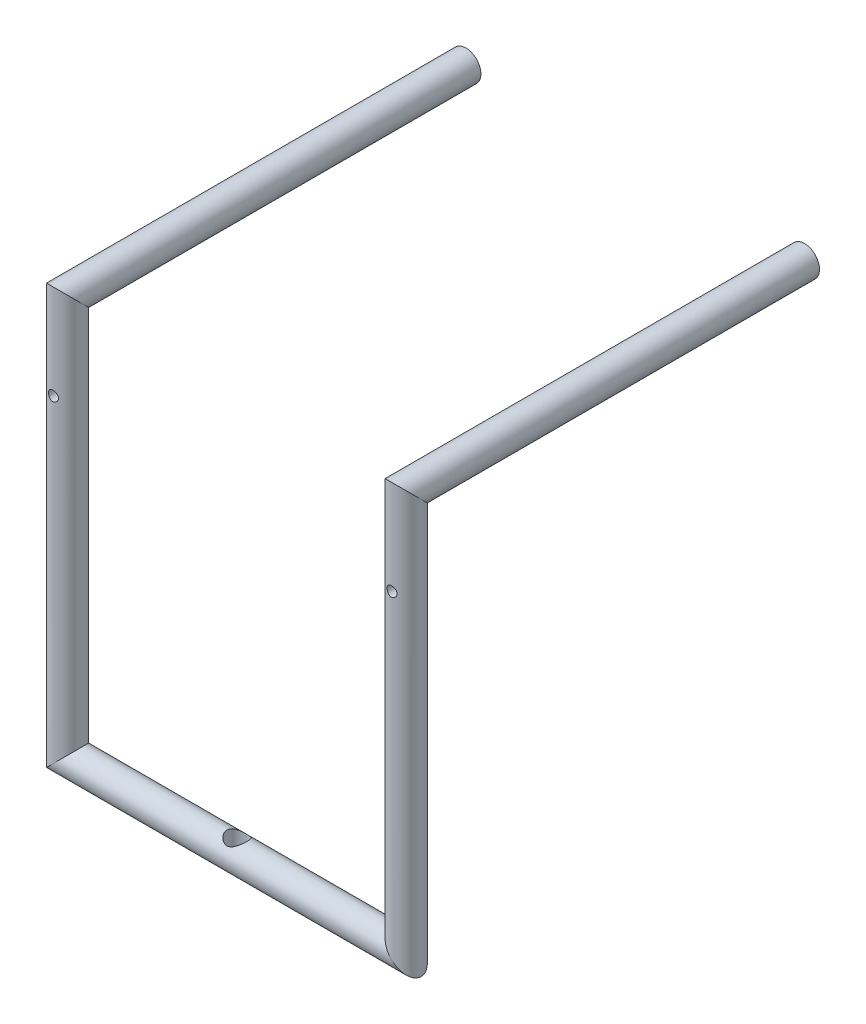
ISO-10303-21;
HEADER;
FILE_DESCRIPTION(('STEP AP214'),'2;1');
FILE_NAME('part.step','',(''),(''),'','','');
FILE_SCHEMA(('AUTOMOTIVE_DESIGN { 1 0 10303 214 1 1 1 1 }'));
ENDSEC;
DATA;
#1=APPLICATION_CONTEXT('core data for automotive mechanical design processes');
#2=APPLICATION_PROTOCOL_DEFINITION('international standard','automotive_design',2000,#1);
#3=PRODUCT_CONTEXT('',#1,'mechanical');
#4=PRODUCT('Part','Part','',(#3));
#5=PRODUCT_RELATED_PRODUCT_CATEGORY('part','',(#4));
#6=PRODUCT_DEFINITION_FORMATION('','',#4);
#7=PRODUCT_DEFINITION_CONTEXT('part definition',#1,'design');
#8=PRODUCT_DEFINITION('design','',#6,#7);
#9=PRODUCT_DEFINITION_SHAPE('','',#8);
#10=(LENGTH_UNIT() NAMED_UNIT(*) SI_UNIT(.MILLI.,.METRE.));
#11=(NAMED_UNIT(*) PLANE_ANGLE_UNIT() SI_UNIT($,.RADIAN.));
#12=(NAMED_UNIT(*) SI_UNIT($,.STERADIAN.) SOLID_ANGLE_UNIT());
#13=UNCERTAINTY_MEASURE_WITH_UNIT(LENGTH_MEASURE(1.E-05),#10,'distance_accuracy_value','');
#14=(GEOMETRIC_REPRESENTATION_CONTEXT(3) GLOBAL_UNCERTAINTY_ASSIGNED_CONTEXT((#13)) GLOBAL_UNIT_ASSIGNED_CONTEXT((#10,
#11,#12)) REPRESENTATION_CONTEXT('',''));
#15=CARTESIAN_POINT('',(0.,0.,0.));
#16=DIRECTION('',(0.,0.,1.));
#17=DIRECTION('',(1.,0.,0.));
#18=AXIS2_PLACEMENT_3D('',#15,#16,#17);
#19=CARTESIAN_POINT('',(8.5,20.,-20.));
#20=DIRECTION('',(0.,0.,1.));
#21=DIRECTION('',(1.,0.,0.));
#22=AXIS2_PLACEMENT_3D('',#19,#20,#21);
#23=PLANE('',#22);
#24=CARTESIAN_POINT('',(8.5,20.,-20.));
#25=DIRECTION('',(0.,0.,1.));
#26=DIRECTION('',(1.,0.,0.));
#27=AXIS2_PLACEMENT_3D('',#24,#25,#26);
#28=CIRCLE('',#27,0.75);
#29=CARTESIAN_POINT('',(9.25,20.,-20.));
#30=VERTEX_POINT('',#29);
#31=EDGE_CURVE('E69',#30,#30,#28,.T.);
#32=ORIENTED_EDGE('',*,*,#31,.F.);
#33=EDGE_LOOP('',(#32));
#34=FACE_BOUND('',#33,.T.);
#35=ADVANCED_FACE('F36',(#34),#23,.F.);
#36=CARTESIAN_POINT('',(-8.5,20.,-20.));
#37=DIRECTION('',(0.,0.,-1.));
#38=DIRECTION('',(-1.,0.,0.));
#39=AXIS2_PLACEMENT_3D('',#36,#37,#38);
#40=PLANE('',#39);
#41=CARTESIAN_POINT('',(-8.5,20.,-20.));
#42=DIRECTION('',(0.,0.,-1.));
#43=DIRECTION('',(-1.,0.,0.));
#44=AXIS2_PLACEMENT_3D('',#41,#42,#43);
#45=CIRCLE('',#44,0.75);
#46=CARTESIAN_POINT('',(-9.25,20.,-20.));
#47=VERTEX_POINT('',#46);
#48=EDGE_CURVE('E49',#47,#47,#45,.T.);
#49=ORIENTED_EDGE('',*,*,#48,.T.);
#50=EDGE_LOOP('',(#49));
#51=FACE_BOUND('',#50,.T.);
#52=ADVANCED_FACE('F153',(#51),#40,.T.);
#53=CARTESIAN_POINT('',(8.5,20.,1.75000000000001));
#54=DIRECTION('',(0.,0.,-1.));
#55=DIRECTION('',(-1.,0.,0.));
#56=AXIS2_PLACEMENT_3D('',#53,#54,#55);
#57=CYLINDRICAL_SURFACE('',#56,0.75);
#58=CARTESIAN_POINT('',(8.5,20.,0.));
#59=DIRECTION('',(0.,0.707106781186547,-0.707106781186547));
#60=DIRECTION('',(0.,0.707106781186548,0.707106781186548));
#61=AXIS2_PLACEMENT_3D('',#58,#59,#60);
#62=ELLIPSE('',#61,1.06066017177982,0.75);
#63=CARTESIAN_POINT('',(8.5,20.75,0.750000000000004));
#64=VERTEX_POINT('',#63);
#65=EDGE_CURVE('E65',#64,#64,#62,.T.);
#66=ORIENTED_EDGE('',*,*,#65,.T.);
#67=EDGE_LOOP('',(#66));
#68=FACE_BOUND('',#67,.T.);
#69=ORIENTED_EDGE('',*,*,#31,.T.);
#70=EDGE_LOOP('',(#69));
#71=FACE_BOUND('',#70,.T.);
#72=ADVANCED_FACE('F147',(#68,#71),#57,.T.);
#73=CARTESIAN_POINT('',(8.5,-0.924999999999999,0.));
#74=DIRECTION('',(0.,1.,0.));
#75=DIRECTION('',(0.,0.,1.));
#76=AXIS2_PLACEMENT_3D('',#73,#74,#75);
#77=CYLINDRICAL_SURFACE('',#76,0.75);
#78=CARTESIAN_POINT('',(8.5,15.75,0.750000000000004));
#79=CARTESIAN_POINT('',(8.48635915927832,15.7499999365671,0.750000038252365));
#80=CARTESIAN_POINT('',(8.47271870136536,15.7511200665318,0.749624423768875));
#81=CARTESIAN_POINT('',(8.44583955978176,15.7555572772043,0.748163025508197));
#82=CARTESIAN_POINT('',(8.4326009179703,15.7588745859872,0.74707716800535));
#83=CARTESIAN_POINT('',(8.40691680262456,15.767579810846,0.744313269766146));
#84=CARTESIAN_POINT('',(8.39447004352849,15.7729642656148,0.742636219327271));
#85=CARTESIAN_POINT('',(8.37065626579867,15.7856352932096,0.738861114293225));
#86=CARTESIAN_POINT('',(8.35928946076033,15.7929222412506,0.736762976668949));
#87=CARTESIAN_POINT('',(8.33756458124443,15.8094564512147,0.732285236108032));
#88=CARTESIAN_POINT('',(8.32724907492541,15.8187578085652,0.729898891161417));
#89=CARTESIAN_POINT('',(8.30829182682449,15.8389417886766,0.725150786955857));
#90=CARTESIAN_POINT('',(8.29965045362768,15.8498247587318,0.722789033219087));
#91=CARTESIAN_POINT('',(8.28404376444299,15.8732462787994,0.718283331200689));
#92=CARTESIAN_POINT('',(8.27713378544457,15.8858234349342,0.71614759821759));
#93=CARTESIAN_POINT('',(8.26554528153075,15.9120440236134,0.71243826351815));
#94=CARTESIAN_POINT('',(8.26086607565398,15.9256871292861,0.710864490295955));
#95=CARTESIAN_POINT('',(8.25403163462292,15.9531683053751,0.708528258276083));
#96=CARTESIAN_POINT('',(8.25179663793083,15.9669843021313,0.707740239800431));
#97=CARTESIAN_POINT('',(8.24966471916504,15.9948159385498,0.706989141947859));
#98=CARTESIAN_POINT('',(8.24976707459879,16.0088315151819,0.707025807655002));
#99=CARTESIAN_POINT('',(8.2522450240745,16.0359841576101,0.707897537426879));
#100=CARTESIAN_POINT('',(8.25451652170835,16.0491321007295,0.708696039643748));
#101=CARTESIAN_POINT('',(8.26109845928755,16.0748483549019,0.710941644336472));
#102=CARTESIAN_POINT('',(8.26540914335201,16.0874165963588,0.712388824467047));
#103=CARTESIAN_POINT('',(8.27601523548497,16.1118531873978,0.715794777821243));
#104=CARTESIAN_POINT('',(8.28234148782319,16.1237070063674,0.717761414480949));
#105=CARTESIAN_POINT('',(8.29677772342421,16.1462177270699,0.721981396441168));
#106=CARTESIAN_POINT('',(8.304888221909,16.1568742817334,0.72423482447667));
#107=CARTESIAN_POINT('',(8.32316266682944,16.1772728995402,0.728918322918823));
#108=CARTESIAN_POINT('',(8.33341171248092,16.1869381736273,0.731351473386968));
#109=CARTESIAN_POINT('',(8.35541510750748,16.2044328166659,0.736017345967739));
#110=CARTESIAN_POINT('',(8.3671696010848,16.2122620095411,0.738250048845211));
#111=CARTESIAN_POINT('',(8.39201309673843,16.2259240750588,0.742292769844449));
#112=CARTESIAN_POINT('',(8.40511418089591,16.2317363728352,0.744098375020092));
#113=CARTESIAN_POINT('',(8.43218272915887,16.2410507934889,0.747051417861101));
#114=CARTESIAN_POINT('',(8.44614989046126,16.2445537188559,0.748199084137203));
#115=CARTESIAN_POINT('',(8.47390404261767,16.2490139165056,0.749669067678604));
#116=CARTESIAN_POINT('',(8.48767260003379,16.2500749522932,0.75002500458433));
#117=CARTESIAN_POINT('',(8.51519376749006,16.2499168316004,0.749972256737066));
#118=CARTESIAN_POINT('',(8.52894637982991,16.248698060005,0.749563701048385));
#119=CARTESIAN_POINT('',(8.55562996657606,16.244097023066,0.748050061792789));
#120=CARTESIAN_POINT('',(8.56857320170871,16.2407784484876,0.746965496778075));
#121=CARTESIAN_POINT('',(8.59371398964489,16.2321516388833,0.744229617075089));
#122=CARTESIAN_POINT('',(8.60591144712714,16.2268431501331,0.742578230116357));
#123=CARTESIAN_POINT('',(8.62957207409833,16.2142323920398,0.738822328218572));
#124=CARTESIAN_POINT('',(8.64100748980433,16.2068813516791,0.736707036890767));
#125=CARTESIAN_POINT('',(8.66251620753385,16.1904514624967,0.732263134789362));
#126=CARTESIAN_POINT('',(8.67258909194872,16.1813720859925,0.729934458979724));
#127=CARTESIAN_POINT('',(8.69156312695175,16.1612553122479,0.725192119956185));
#128=CARTESIAN_POINT('',(8.70039024231212,16.1501476932667,0.722779402737892));
#129=CARTESIAN_POINT('',(8.71606438058021,16.1265571080489,0.718249933217457));
#130=CARTESIAN_POINT('',(8.72291138698021,16.1140741303475,0.716133183382804));
#131=CARTESIAN_POINT('',(8.73439923260584,16.0880817461734,0.712455979550775));
#132=CARTESIAN_POINT('',(8.73904453304944,16.0745744801893,0.710894402251584));
#133=CARTESIAN_POINT('',(8.74597366669804,16.046905337469,0.708527080997838));
#134=CARTESIAN_POINT('',(8.74825856374031,16.0327437586417,0.70772099655675));
#135=CARTESIAN_POINT('',(8.7503190706176,16.0049507259967,0.706994647187682));
#136=CARTESIAN_POINT('',(8.75021756432773,15.9913294149371,0.707031000860752));
#137=CARTESIAN_POINT('',(8.74781057336372,15.9643087312751,0.707878174808904));
#138=CARTESIAN_POINT('',(8.74550521986472,15.9509093455118,0.708688948989715));
#139=CARTESIAN_POINT('',(8.73884295328175,15.9249660842468,0.710961310697363));
#140=CARTESIAN_POINT('',(8.73452583650372,15.9124107937482,0.712410245038789));
#141=CARTESIAN_POINT('',(8.7239948414401,15.8881931482661,0.715790997063588));
#142=CARTESIAN_POINT('',(8.7177805421385,15.8765309922032,0.717722921913245));
#143=CARTESIAN_POINT('',(8.70331517314581,15.8538790825191,0.721957073060153));
#144=CARTESIAN_POINT('',(8.69498706069113,15.8429408745254,0.724271779104014));
#145=CARTESIAN_POINT('',(8.67666072078393,15.822577546654,0.728958390709469));
#146=CARTESIAN_POINT('',(8.66666202111288,15.813152856078,0.731330312281298));
#147=CARTESIAN_POINT('',(8.64481038923017,15.7957138969277,0.735975076313487));
#148=CARTESIAN_POINT('',(8.63290037837493,15.7877689130622,0.738240454503045));
#149=CARTESIAN_POINT('',(8.60783933935166,15.7740023927873,0.742314977931635));
#150=CARTESIAN_POINT('',(8.59468862953309,15.7681803135195,0.744124239769855));
#151=CARTESIAN_POINT('',(8.56812341180024,15.7590695918778,0.747013787671333));
#152=CARTESIAN_POINT('',(8.5547469394191,15.7556793834342,0.748123031056305));
#153=CARTESIAN_POINT('',(8.52758010400256,15.7511449298307,0.749616017660565));
#154=CARTESIAN_POINT('',(8.51378985639219,15.7500000641259,0.749999961329765));
#155=CARTESIAN_POINT('',(8.5,15.75,0.750000000000004));
#156=B_SPLINE_CURVE_WITH_KNOTS('',3,(#78,#79,#80,#81,#82,#83,#84,#85,#86,#87,#88,#89,#90,#91,
#92,#93,#94,#95,#96,#97,#98,#99,#100,#101,#102,#103,#104,#105,#106,#107,#108,#109,#110,#111,
#112,#113,#114,#115,#116,#117,#118,#119,#120,#121,#122,#123,#124,#125,#126,#127,#128,#129,#130,
#131,#132,#133,#134,#135,#136,#137,#138,#139,#140,#141,#142,#143,#144,#145,#146,#147,#148,#149,
#150,#151,#152,#153,#154,#155),.UNSPECIFIED.,.T.,.F.,(4,2,2,2,2,2,2,2,2,2,2,2,2,2,2,2,2,2,2,2,2,
2,2,2,2,2,2,2,2,2,2,2,2,2,2,2,2,2,4),(0.,0.0408717765065024,0.0817477963168796,
0.122555668217568,0.163371594449774,0.205461710706887,0.247561083218825,0.290870962058673,
0.334167611732079,0.376004814343956,0.417829084947086,0.457742066356575,0.497659827117077,
0.538220427866203,0.578792756373893,0.621483264506793,0.664177864894922,0.707296014104266,
0.750399172171393,0.791633957916297,0.832861782888813,0.872895394923909,0.912934113188633,
0.954025999587717,0.995130452033104,1.03810255718025,1.08107502056586,1.12396003453941,
1.16682571173049,1.20748916511992,1.24815019833134,1.28803896765395,1.32793659539284,
1.36957516668241,1.41122552776235,1.45449915204065,1.49776170283404,1.53909139588743,
1.58040966504825),.UNSPECIFIED.);
#157=CARTESIAN_POINT('',(8.5,15.75,0.750000000000004));
#158=VERTEX_POINT('',#157);
#159=EDGE_CURVE('E39',#158,#158,#156,.T.);
#160=ORIENTED_EDGE('',*,*,#159,.T.);
#161=EDGE_LOOP('',(#160));
#162=FACE_BOUND('',#161,.T.);
#163=CARTESIAN_POINT('',(8.75,16.,-0.707106781186544));
#164=CARTESIAN_POINT('',(8.75000006448695,16.0136170437027,-0.707106736331833));
#165=CARTESIAN_POINT('',(8.74888369592454,16.0272336999429,-0.707504423432013));
#166=CARTESIAN_POINT('',(8.74446278292564,16.0540636052377,-0.709043935436447));
#167=CARTESIAN_POINT('',(8.74115787804267,16.067276787466,-0.710185882918048));
#168=CARTESIAN_POINT('',(8.73248887142007,16.0929067232532,-0.713070509159717));
#169=CARTESIAN_POINT('',(8.7271288053505,16.1053249823617,-0.714812009911598));
#170=CARTESIAN_POINT('',(8.71451540711066,16.129090012136,-0.718697805042516));
#171=CARTESIAN_POINT('',(8.70726165721513,16.1404365456381,-0.720842188263578));
#172=CARTESIAN_POINT('',(8.69076278661063,16.1621799905849,-0.725386223513969));
#173=CARTESIAN_POINT('',(8.68145608534446,16.172528857168,-0.727792237110344));
#174=CARTESIAN_POINT('',(8.66124691680362,16.1915517003061,-0.732534662003768));
#175=CARTESIAN_POINT('',(8.6503441937631,16.2002254078956,-0.734871062072744));
#176=CARTESIAN_POINT('',(8.62690112699124,16.2158697243324,-0.739284667304143));
#177=CARTESIAN_POINT('',(8.61432547780613,16.2227899926545,-0.741353519253918));
#178=CARTESIAN_POINT('',(8.58810780574687,16.2343978962819,-0.744923966927548));
#179=CARTESIAN_POINT('',(8.5744660714218,16.2390861332942,-0.746425715507526));
#180=CARTESIAN_POINT('',(8.54700720435837,16.2459339636581,-0.748647688579741));
#181=CARTESIAN_POINT('',(8.53321268871324,16.2481758615642,-0.749393286943893));
#182=CARTESIAN_POINT('',(8.50542446870602,16.2503290733402,-0.750109020545619));
#183=CARTESIAN_POINT('',(8.49143081661402,16.2502409879131,-0.750079355657222));
#184=CARTESIAN_POINT('',(8.46422412120154,16.2477889363585,-0.749265099046838));
#185=CARTESIAN_POINT('',(8.45100198785208,16.2455143678814,-0.748510161887843));
#186=CARTESIAN_POINT('',(8.42513914029446,16.2389017547549,-0.746367418349273));
#187=CARTESIAN_POINT('',(8.4124984655552,16.2345635702551,-0.744979569077753));
#188=CARTESIAN_POINT('',(8.3879618812895,16.2238946706735,-0.741689175733258));
#189=CARTESIAN_POINT('',(8.37607794475775,16.2175385153633,-0.739780106310789));
#190=CARTESIAN_POINT('',(8.35351891861821,16.2030350736379,-0.735645982596541));
#191=CARTESIAN_POINT('',(8.34284416640381,16.1948872891683,-0.733420840500849));
#192=CARTESIAN_POINT('',(8.32247478336202,16.1765814016348,-0.728765479627685));
#193=CARTESIAN_POINT('',(8.31284996073311,16.1663467105386,-0.726330537933431));
#194=CARTESIAN_POINT('',(8.29543068510103,16.1443878185694,-0.721618338111007));
#195=CARTESIAN_POINT('',(8.28763651418176,16.1326633885718,-0.719341104322013));
#196=CARTESIAN_POINT('',(8.27400313623931,16.1078365935961,-0.715176312845526));
#197=CARTESIAN_POINT('',(8.2681933840872,16.0947169671577,-0.71329477337223));
#198=CARTESIAN_POINT('',(8.25888920167516,16.0676071514338,-0.710204127170575));
#199=CARTESIAN_POINT('',(8.25539380106126,16.0536173296959,-0.708994738659094));
#200=CARTESIAN_POINT('',(8.25095967947774,16.0258404111517,-0.707449090845068));
#201=CARTESIAN_POINT('',(8.24991272612355,16.0120726438152,-0.707075901115858));
#202=CARTESIAN_POINT('',(8.2500986402721,15.9845559627207,-0.707141680483065));
#203=CARTESIAN_POINT('',(8.25133109369357,15.9708070459924,-0.707580502068008));
#204=CARTESIAN_POINT('',(8.25594358711219,15.9442107585706,-0.70918404514049));
#205=CARTESIAN_POINT('',(8.2592484015049,15.9313486424619,-0.710323313579228));
#206=CARTESIAN_POINT('',(8.26782153435981,15.9063640984406,-0.713171384200429));
#207=CARTESIAN_POINT('',(8.27309020090913,15.8942418021024,-0.714880287343315));
#208=CARTESIAN_POINT('',(8.28563141481529,15.8706548947881,-0.718742193983049));
#209=CARTESIAN_POINT('',(8.29296222041038,15.8592233393395,-0.720907564162346));
#210=CARTESIAN_POINT('',(8.3093535923606,15.8377134869041,-0.725414421829133));
#211=CARTESIAN_POINT('',(8.3184146686253,15.8276355903347,-0.727755961109954));
#212=CARTESIAN_POINT('',(8.33852707352492,15.8086180039773,-0.732487596594125));
#213=CARTESIAN_POINT('',(8.34965318236334,15.7997564024953,-0.734874608944606));
#214=CARTESIAN_POINT('',(8.37329317714994,15.784020964413,-0.739317129032901));
#215=CARTESIAN_POINT('',(8.38580701378386,15.7771470572094,-0.741372648544269));
#216=CARTESIAN_POINT('',(8.41180503439193,15.7656449737846,-0.74491101452647));
#217=CARTESIAN_POINT('',(8.4252822191697,15.761002180713,-0.746397575011316));
#218=CARTESIAN_POINT('',(8.4528853835385,15.754068064485,-0.748646527094442));
#219=CARTESIAN_POINT('',(8.46701112701153,15.7517758925299,-0.749409180085045));
#220=CARTESIAN_POINT('',(8.49479616603499,15.7496844805986,-0.750104658090637));
#221=CARTESIAN_POINT('',(8.50844618098001,15.7497731365169,-0.7500748002236));
#222=CARTESIAN_POINT('',(8.53552778625004,15.7521643270366,-0.749280491298487));
#223=CARTESIAN_POINT('',(8.54895939420476,15.7544666820382,-0.748516099833915));
#224=CARTESIAN_POINT('',(8.57501052985802,15.761145558644,-0.746352287386049));
#225=CARTESIAN_POINT('',(8.5876395677282,15.7654885538382,-0.744963145902946));
#226=CARTESIAN_POINT('',(8.61199458773495,15.7760943827743,-0.741692901761157));
#227=CARTESIAN_POINT('',(8.6237204060356,15.7823575637992,-0.739811710119749));
#228=CARTESIAN_POINT('',(8.6464085040772,15.7968923780255,-0.735664672069999));
#229=CARTESIAN_POINT('',(8.65732656288943,15.8052296713455,-0.73338718123095));
#230=CARTESIAN_POINT('',(8.67764525656809,15.823564347789,-0.728732471978558));
#231=CARTESIAN_POINT('',(8.68704540540607,15.8335622605654,-0.726355221928489));
#232=CARTESIAN_POINT('',(8.70443545220837,15.855402338897,-0.721658199568409));
#233=CARTESIAN_POINT('',(8.71235574149981,15.8673013777452,-0.719344319988358));
#234=CARTESIAN_POINT('',(8.72607858582495,15.8923336067247,-0.715150483290754));
#235=CARTESIAN_POINT('',(8.73188169420364,15.9054664732536,-0.713270412840421));
#236=CARTESIAN_POINT('',(8.74096095705166,15.931990456006,-0.710253335576334));
#237=CARTESIAN_POINT('',(8.74433947729082,15.9453430658914,-0.709086582361996));
#238=CARTESIAN_POINT('',(8.74885858004042,15.9724640126289,-0.707513459034846));
#239=CARTESIAN_POINT('',(8.74999993479913,15.9862322043589,-0.707106826537834));
#240=CARTESIAN_POINT('',(8.75,16.,-0.707106781186544));
#241=B_SPLINE_CURVE_WITH_KNOTS('',3,(#163,#164,#165,#166,#167,#168,#169,#170,#171,#172,#173,
#174,#175,#176,#177,#178,#179,#180,#181,#182,#183,#184,#185,#186,#187,#188,#189,#190,#191,#192,
#193,#194,#195,#196,#197,#198,#199,#200,#201,#202,#203,#204,#205,#206,#207,#208,#209,#210,#211,
#212,#213,#214,#215,#216,#217,#218,#219,#220,#221,#222,#223,#224,#225,#226,#227,#228,#229,#230,
#231,#232,#233,#234,#235,#236,#237,#238,#239,#240),.UNSPECIFIED.,.T.,.F.,(4,2,2,2,2,2,2,2,2,2,2,
2,2,2,2,2,2,2,2,2,2,2,2,2,2,2,2,2,2,2,2,2,2,2,2,2,2,2,4),(0.,0.0408001461938548,
0.0816070137422216,0.122334156863638,0.16307029153479,0.20525334355735,0.247443162918401,
0.290733765347575,0.334012690955403,0.375785796900768,0.417548133244248,0.457672512052353,
0.497799610461523,0.538454137139267,0.579119979673484,0.621700435898221,0.664287449018692,
0.707481599593439,0.750657628374222,0.791885728384316,0.83310633955686,0.872910989385717,
0.912722697831141,0.953797144303064,0.994883714119094,1.03794702039151,1.08100879685761,
1.12378447794091,1.16654470747417,1.20729521165786,1.24804240998823,1.28814239006485,
1.32824962687188,1.36983879876536,1.41144126104536,1.45467225680414,1.49789194563094,
1.53915803036531,1.58040986792917),.UNSPECIFIED.);
#242=CARTESIAN_POINT('',(8.75,16.,-0.707106781186544));
#243=VERTEX_POINT('',#242);
#244=EDGE_CURVE('E119',#243,#243,#241,.T.);
#245=ORIENTED_EDGE('',*,*,#244,.T.);
#246=EDGE_LOOP('',(#245));
#247=FACE_BOUND('',#246,.T.);
#248=CARTESIAN_POINT('',(8.5,0.,0.));
#249=DIRECTION('',(0.707106781186547,0.707106781186548,0.));
#250=DIRECTION('',(0.707106781186548,-0.707106781186547,0.));
#251=AXIS2_PLACEMENT_3D('',#248,#249,#250);
#252=ELLIPSE('',#251,1.06066017177982,0.75);
#253=CARTESIAN_POINT('',(9.25,-0.749999999999995,0.));
#254=VERTEX_POINT('',#253);
#255=EDGE_CURVE('E61',#254,#254,#252,.T.);
#256=ORIENTED_EDGE('',*,*,#255,.T.);
#257=EDGE_LOOP('',(#256));
#258=FACE_BOUND('',#257,.T.);
#259=ORIENTED_EDGE('',*,*,#65,.F.);
#260=EDGE_LOOP('',(#259));
#261=FACE_BOUND('',#260,.T.);
#262=ADVANCED_FACE('F141',(#162,#247,#258,#261),#77,.T.);
#263=CARTESIAN_POINT('',(-9.425,0.,0.));
#264=DIRECTION('',(1.,0.,0.));
#265=DIRECTION('',(0.,1.,0.));
#266=AXIS2_PLACEMENT_3D('',#263,#264,#265);
#267=CYLINDRICAL_SURFACE('',#266,0.75);
#268=CARTESIAN_POINT('',(-0.5,0.750000000000004,0.));
#269=CARTESIAN_POINT('',(-0.500000137408382,0.750000104111127,-0.0251211791672709));
#270=CARTESIAN_POINT('',(-0.498096507511196,0.748727006883213,-0.0502422717832902));
#271=CARTESIAN_POINT('',(-0.490600783973515,0.743761631059787,-0.0996832645078483));
#272=CARTESIAN_POINT('',(-0.485006939219158,0.74006820395316,-0.12400277848873));
#273=CARTESIAN_POINT('',(-0.47047307066881,0.730626206011704,-0.171053076963577));
#274=CARTESIAN_POINT('',(-0.461548714998022,0.724887263733272,-0.19379071816439));
#275=CARTESIAN_POINT('',(-0.440734159182122,0.711815344693623,-0.237353822749307));
#276=CARTESIAN_POINT('',(-0.42884352842486,0.704482136513783,-0.258179007902412));
#277=CARTESIAN_POINT('',(-0.401335765658146,0.688068323424594,-0.299321175192525));
#278=CARTESIAN_POINT('',(-0.38548803481428,0.678892243948301,-0.319445076365166));
#279=CARTESIAN_POINT('',(-0.35106748783539,0.659955782708669,-0.356932011173181));
#280=CARTESIAN_POINT('',(-0.332490767540568,0.650194575892082,-0.374291013859717));
#281=CARTESIAN_POINT('',(-0.289736908096836,0.629320661696989,-0.408555744363738));
#282=CARTESIAN_POINT('',(-0.265138586699143,0.6182376698445,-0.424957965906875));
#283=CARTESIAN_POINT('',(-0.212909155588369,0.597710368382043,-0.453375892535432));
#284=CARTESIAN_POINT('',(-0.185283399609309,0.588263239886636,-0.465399183566246));
#285=CARTESIAN_POINT('',(-0.135822176644605,0.574940666603679,-0.4816850875286));
#286=CARTESIAN_POINT('',(-0.11461788678155,0.570244069731091,-0.48718611809004));
#287=CARTESIAN_POINT('',(-0.0713138738145712,0.56314492414893,-0.495376544463049));
#288=CARTESIAN_POINT('',(-0.0492157628184095,0.560738421860067,-0.49807078662983));
#289=CARTESIAN_POINT('',(-0.00463130528596799,0.558591514020418,-0.500478410353147));
#290=CARTESIAN_POINT('',(0.0178562558627944,0.558862006397392,-0.500179607294101));
#291=CARTESIAN_POINT('',(0.0624087433752353,0.562049438707427,-0.496593953333098));
#292=CARTESIAN_POINT('',(0.0844732955081532,0.564968620712959,-0.493304570949893));
#293=CARTESIAN_POINT('',(0.126616762809391,0.572817964978955,-0.484162485544357));
#294=CARTESIAN_POINT('',(0.146740333980758,0.577653720825765,-0.478429278702503));
#295=CARTESIAN_POINT('',(0.185755922747872,0.588774057319225,-0.464675296454753));
#296=CARTESIAN_POINT('',(0.204647532574311,0.595059114581941,-0.456653768307179));
#297=CARTESIAN_POINT('',(0.244756348820565,0.609910491011059,-0.436684546849162));
#298=CARTESIAN_POINT('',(0.265664975047025,0.618680794622535,-0.424270130821924));
#299=CARTESIAN_POINT('',(0.305345848745947,0.636728844612416,-0.396672401168268));
#300=CARTESIAN_POINT('',(0.32411541441856,0.646007206854732,-0.381485672520173));
#301=CARTESIAN_POINT('',(0.363135636427778,0.666358359310477,-0.34495291327986));
#302=CARTESIAN_POINT('',(0.382833512177846,0.677386861775123,-0.322984845702254));
#303=CARTESIAN_POINT('',(0.418299123627464,0.698045251689282,-0.275501999776911));
#304=CARTESIAN_POINT('',(0.43407053635052,0.707676444126421,-0.249990574837589));
#305=CARTESIAN_POINT('',(0.458369429657098,0.722863510220834,-0.201214456772806));
#306=CARTESIAN_POINT('',(0.467710840835101,0.728848152912501,-0.178489410842624));
#307=CARTESIAN_POINT('',(0.483026231405972,0.738769297577597,-0.131509010984238));
#308=CARTESIAN_POINT('',(0.48900305678296,0.742707530319185,-0.10725496975053));
#309=CARTESIAN_POINT('',(0.49729029130959,0.748189705391698,-0.0577463632929663));
#310=CARTESIAN_POINT('',(0.499584865234564,0.749723306153027,-0.0324879529834659));
#311=CARTESIAN_POINT('',(0.500311772140553,0.750207787412814,0.0181103798472502));
#312=CARTESIAN_POINT('',(0.498744375122292,0.749158848463538,0.0434502965464401));
#313=CARTESIAN_POINT('',(0.492093986109421,0.7447489735612,0.0916139293012494));
#314=CARTESIAN_POINT('',(0.487265675560843,0.741555615977502,0.114489361170477));
#315=CARTESIAN_POINT('',(0.474601078497139,0.733296123210166,0.15902909810616));
#316=CARTESIAN_POINT('',(0.466764312269268,0.728229689360262,0.180693209390235));
#317=CARTESIAN_POINT('',(0.447836925737374,0.716240881330553,0.223666187619192));
#318=CARTESIAN_POINT('',(0.436577961474172,0.709224675368834,0.244874046168197));
#319=CARTESIAN_POINT('',(0.411391677518805,0.694004638999402,0.285170755978965));
#320=CARTESIAN_POINT('',(0.397462709887049,0.685800075899957,0.304258287011496));
#321=CARTESIAN_POINT('',(0.364848032935817,0.667386366759992,0.342963613752489));
#322=CARTESIAN_POINT('',(0.345758434884651,0.657065392508566,0.362187969107));
#323=CARTESIAN_POINT('',(0.304722142428774,0.636427933164411,0.397334920341903));
#324=CARTESIAN_POINT('',(0.282773490227834,0.626111456053188,0.413255234160116));
#325=CARTESIAN_POINT('',(0.238214396806748,0.607349197419914,0.440311941355806));
#326=CARTESIAN_POINT('',(0.215816991555758,0.598818992913366,0.451739090391142));
#327=CARTESIAN_POINT('',(0.169031836799048,0.583597436065468,0.471240534449156));
#328=CARTESIAN_POINT('',(0.14464776539976,0.57690278142106,0.479320864229593));
#329=CARTESIAN_POINT('',(0.0988588782176287,0.567333020376762,0.490589608644373));
#330=CARTESIAN_POINT('',(0.0777070475356282,0.563987495033089,0.494396493911008));
#331=CARTESIAN_POINT('',(0.0348566796657873,0.559698666116042,0.499248014812979));
#332=CARTESIAN_POINT('',(0.0131587622130977,0.558752753370009,0.500295650712541));
#333=CARTESIAN_POINT('',(-0.0301607641788868,0.559410502874498,0.499559804953917));
#334=CARTESIAN_POINT('',(-0.0517823203399244,0.56101567478688,0.497774646927017));
#335=CARTESIAN_POINT('',(-0.0943358821365415,0.566526130990495,0.491492493054296));
#336=CARTESIAN_POINT('',(-0.115266928468112,0.570434483745576,0.486991879291104));
#337=CARTESIAN_POINT('',(-0.161427796603454,0.581317109854672,0.473982589181603));
#338=CARTESIAN_POINT('',(-0.186316928169277,0.588830834329033,0.464725467985518));
#339=CARTESIAN_POINT('',(-0.23387170856021,0.605555403089715,0.442711315722898));
#340=CARTESIAN_POINT('',(-0.256534174542577,0.614768624098236,0.429949370837965));
#341=CARTESIAN_POINT('',(-0.2998204717389,0.634042966563618,0.400995701403134));
#342=CARTESIAN_POINT('',(-0.320399686135662,0.64411646926505,0.384745774934198));
#343=CARTESIAN_POINT('',(-0.358830619334012,0.664070754688602,0.349179420301653));
#344=CARTESIAN_POINT('',(-0.376681499191283,0.67395147732069,0.329862052628809));
#345=CARTESIAN_POINT('',(-0.411678026151302,0.69407887963527,0.28536433237061));
#346=CARTESIAN_POINT('',(-0.428354660064235,0.704174513551979,0.259740417369868));
#347=CARTESIAN_POINT('',(-0.456978319146698,0.721944164758293,0.205217138961849));
#348=CARTESIAN_POINT('',(-0.468932776701343,0.729621983630387,0.176323015616798));
#349=CARTESIAN_POINT('',(-0.485288644544558,0.740254112078826,0.122858767455435));
#350=CARTESIAN_POINT('',(-0.490777759775621,0.743878700918745,0.098753081313545));
#351=CARTESIAN_POINT('',(-0.498132008133556,0.748750700358228,0.0497645030069286));
#352=CARTESIAN_POINT('',(-0.499999863898742,0.749999896879258,0.0248822090472581));
#353=CARTESIAN_POINT('',(-0.5,0.750000000000004,0.));
#354=B_SPLINE_CURVE_WITH_KNOTS('',3,(#268,#269,#270,#271,#272,#273,#274,#275,#276,#277,#278,
#279,#280,#281,#282,#283,#284,#285,#286,#287,#288,#289,#290,#291,#292,#293,#294,#295,#296,#297,
#298,#299,#300,#301,#302,#303,#304,#305,#306,#307,#308,#309,#310,#311,#312,#313,#314,#315,#316,
#317,#318,#319,#320,#321,#322,#323,#324,#325,#326,#327,#328,#329,#330,#331,#332,#333,#334,#335,
#336,#337,#338,#339,#340,#341,#342,#343,#344,#345,#346,#347,#348,#349,#350,#351,#352,#353),
.UNSPECIFIED.,.T.,.F.,(4,2,2,2,2,2,2,2,2,2,2,2,2,2,2,2,2,2,2,2,2,2,2,2,2,2,2,2,2,2,2,2,2,2,2,2,
2,2,2,2,2,2,4),(0.,0.0752633066263498,0.150562353587172,0.225511538297558,0.300471609668466,
0.381792572501391,0.463231029010796,0.557516708239955,0.651638263613597,0.718584234190072,
0.785414419614522,0.852516779338444,0.91967599315838,0.983872155495054,1.04808945951269,
1.12536893664898,1.20274425944606,1.2967973862378,1.39076210074932,1.46631021923781,
1.54179433785295,1.61760220823154,1.69340477882946,1.7638827119771,1.83437188784159,
1.90913086706971,1.98393613735893,2.0705704403568,2.1572643829461,2.23662483825929,
2.31584156658732,2.38081012002585,2.44570800081824,2.51064430069688,2.57566730961651,
2.65801652174084,2.74048178342372,2.82444811298971,2.90844020991044,3.00448837888214,
3.10038476638713,3.17498822840193,3.24953557813398),.UNSPECIFIED.);
#355=CARTESIAN_POINT('',(-0.5,0.750000000000004,0.));
#356=VERTEX_POINT('',#355);
#357=EDGE_CURVE('E73',#356,#356,#354,.T.);
#358=ORIENTED_EDGE('',*,*,#357,.T.);
#359=EDGE_LOOP('',(#358));
#360=FACE_BOUND('',#359,.T.);
#361=CARTESIAN_POINT('',(0.,-0.559016994374948,0.5));
#362=CARTESIAN_POINT('',(0.0244070776840955,-0.559019383213538,0.49999863498352));
#363=CARTESIAN_POINT('',(0.0488226884182982,-0.560645177499701,0.498197481256266));
#364=CARTESIAN_POINT('',(0.0967799779214889,-0.566829931373142,0.491145670797246));
#365=CARTESIAN_POINT('',(0.120320008884651,-0.571394152063539,0.485888826470456));
#366=CARTESIAN_POINT('',(0.165683860466932,-0.582641464532403,0.472339654190862));
#367=CARTESIAN_POINT('',(0.187521924183623,-0.589303904477976,0.464076795035392));
#368=CARTESIAN_POINT('',(0.22946645808711,-0.603960236712971,0.444835020984148));
#369=CARTESIAN_POINT('',(0.249572567494099,-0.611954405399419,0.43385554203058));
#370=CARTESIAN_POINT('',(0.290911721903808,-0.629865182327165,0.407506025019365));
#371=CARTESIAN_POINT('',(0.311833029429035,-0.639887340225052,0.391718588629477));
#372=CARTESIAN_POINT('',(0.351000677218426,-0.659862068270853,0.357048049351915));
#373=CARTESIAN_POINT('',(0.369244380414451,-0.669814560745067,0.33816193294292));
#374=CARTESIAN_POINT('',(0.40516091469522,-0.690222046309016,0.294539226235977));
#375=CARTESIAN_POINT('',(0.422370627943749,-0.70054196461714,0.269351609914802));
#376=CARTESIAN_POINT('',(0.45216052387239,-0.71889621120689,0.215617741053338));
#377=CARTESIAN_POINT('',(0.464745878507682,-0.726933090577532,0.187075288080715));
#378=CARTESIAN_POINT('',(0.483389100254283,-0.738999768661744,0.130812268370296));
#379=CARTESIAN_POINT('',(0.490020836123828,-0.743377939039621,0.103358681295646));
#380=CARTESIAN_POINT('',(0.498546122320886,-0.749024363654786,0.0474238621827459));
#381=CARTESIAN_POINT('',(0.500445639806351,-0.750296534405889,0.0189439703217286));
#382=CARTESIAN_POINT('',(0.499456887512755,-0.74963840430739,-0.0335367625578241));
#383=CARTESIAN_POINT('',(0.497252737170764,-0.748165662275334,-0.0575601595019355));
#384=CARTESIAN_POINT('',(0.489477237160325,-0.743020456975081,-0.104809658317514));
#385=CARTESIAN_POINT('',(0.483905641924176,-0.739347833282791,-0.128035701912199));
#386=CARTESIAN_POINT('',(0.469701078801438,-0.73013022925939,-0.17301948441757));
#387=CARTESIAN_POINT('',(0.461080278700454,-0.724592694956752,-0.194782655961271));
#388=CARTESIAN_POINT('',(0.441111589261909,-0.712052761190785,-0.236552287663176));
#389=CARTESIAN_POINT('',(0.429763202124747,-0.705050094362975,-0.256558426242141));
#390=CARTESIAN_POINT('',(0.403005315635175,-0.689045146126838,-0.297071072990658));
#391=CARTESIAN_POINT('',(0.387258119161965,-0.67990102198015,-0.317297870249071));
#392=CARTESIAN_POINT('',(0.353025330130109,-0.661001504567591,-0.354997018745572));
#393=CARTESIAN_POINT('',(0.334535513516751,-0.651245182038178,-0.372465033798458));
#394=CARTESIAN_POINT('',(0.292009197446911,-0.630375112360484,-0.406930588315245));
#395=CARTESIAN_POINT('',(0.267557230071628,-0.61928580002244,-0.423433982815731));
#396=CARTESIAN_POINT('',(0.215622540195097,-0.598689027077824,-0.452087187363571));
#397=CARTESIAN_POINT('',(0.188145001396808,-0.589178928837278,-0.464244296637116));
#398=CARTESIAN_POINT('',(0.138820234482036,-0.575657175767315,-0.480831811419357));
#399=CARTESIAN_POINT('',(0.117601657486107,-0.570850911444305,-0.486476979368779));
#400=CARTESIAN_POINT('',(0.0742401275460678,-0.563522599473984,-0.49494888894997));
#401=CARTESIAN_POINT('',(0.052098847207062,-0.560996591955614,-0.497780517410882));
#402=CARTESIAN_POINT('',(0.00738925338998507,-0.558618892468721,-0.500448500372263));
#403=CARTESIAN_POINT('',(-0.0151804946294684,-0.558778834667256,-0.500271824383034));
#404=CARTESIAN_POINT('',(-0.0599209584887972,-0.561774700921252,-0.496904074290662));
#405=CARTESIAN_POINT('',(-0.0820913360276856,-0.564612794117991,-0.493710556724944));
#406=CARTESIAN_POINT('',(-0.124347354386199,-0.572319943755704,-0.484749527968672));
#407=CARTESIAN_POINT('',(-0.144481927246659,-0.577082967688512,-0.479115436328642));
#408=CARTESIAN_POINT('',(-0.183531559016103,-0.588074896319842,-0.46555760406773));
#409=CARTESIAN_POINT('',(-0.202446205754525,-0.594304293183551,-0.457633094499908));
#410=CARTESIAN_POINT('',(-0.242550500943962,-0.609028709053583,-0.437908366515756));
#411=CARTESIAN_POINT('',(-0.263439202815248,-0.617727703844009,-0.425650072113155));
#412=CARTESIAN_POINT('',(-0.303104200582258,-0.635656287282266,-0.398381828822968));
#413=CARTESIAN_POINT('',(-0.321877879164482,-0.644886512446432,-0.383368529729881));
#414=CARTESIAN_POINT('',(-0.3609905868924,-0.665189195707868,-0.347191644256552));
#415=CARTESIAN_POINT('',(-0.380775712068712,-0.676223630321172,-0.325400966279177));
#416=CARTESIAN_POINT('',(-0.416454170728045,-0.696938954629091,-0.27827487217241));
#417=CARTESIAN_POINT('',(-0.432350942812355,-0.706621036979587,-0.252942619366141));
#418=CARTESIAN_POINT('',(-0.456972934730587,-0.721977053100566,-0.204371868704487));
#419=CARTESIAN_POINT('',(-0.466489126110321,-0.728063645276137,-0.181665591221556));
#420=CARTESIAN_POINT('',(-0.482151798579665,-0.738196769668837,-0.134689269755801));
#421=CARTESIAN_POINT('',(-0.488301125714782,-0.742245024680236,-0.110420565965124));
#422=CARTESIAN_POINT('',(-0.496924240959738,-0.74794591006653,-0.0608423480760672));
#423=CARTESIAN_POINT('',(-0.499381669876642,-0.749587877141394,-0.0355287092313029));
#424=CARTESIAN_POINT('',(-0.500411962854291,-0.750274552572562,0.0152138866448014));
#425=CARTESIAN_POINT('',(-0.498985187989176,-0.749319502346639,0.0406428327378389));
#426=CARTESIAN_POINT('',(-0.492585127748773,-0.745073889943921,0.0889393831319741));
#427=CARTESIAN_POINT('',(-0.487877253784227,-0.741958193026852,0.111858785768138));
#428=CARTESIAN_POINT('',(-0.475440497642743,-0.73384026551521,0.156504605748236));
#429=CARTESIAN_POINT('',(-0.467711146164711,-0.728837741859698,0.1782308371686));
#430=CARTESIAN_POINT('',(-0.449015323777597,-0.716979413724146,0.221286824154885));
#431=CARTESIAN_POINT('',(-0.437887423120558,-0.710033122398837,0.242520897311469));
#432=CARTESIAN_POINT('',(-0.41296233884947,-0.694938520555841,0.282888165658915));
#433=CARTESIAN_POINT('',(-0.399163558033892,-0.686789491490092,0.30202009296871));
#434=CARTESIAN_POINT('',(-0.366842774389125,-0.668482328822577,0.340823555555942));
#435=CARTESIAN_POINT('',(-0.347919243976969,-0.658209785262211,0.360106699021092));
#436=CARTESIAN_POINT('',(-0.307221614512108,-0.637633394674333,0.395400055909322));
#437=CARTESIAN_POINT('',(-0.285445402771146,-0.627329530029992,0.411407820861152));
#438=CARTESIAN_POINT('',(-0.241033102331494,-0.608460533879777,0.438783133747655));
#439=CARTESIAN_POINT('',(-0.218589547501262,-0.599822716954038,0.450411617234017));
#440=CARTESIAN_POINT('',(-0.171678887763389,-0.584368753878653,0.470289505859438));
#441=CARTESIAN_POINT('',(-0.147215826600274,-0.577549077747081,0.47854547569061));
#442=CARTESIAN_POINT('',(-0.102307132863304,-0.567977630210559,0.489840656181975));
#443=CARTESIAN_POINT('',(-0.0821729406695293,-0.564659239832199,0.493630570965651));
#444=CARTESIAN_POINT('',(-0.0413608997308107,-0.560178799340737,0.498709789581945));
#445=CARTESIAN_POINT('',(-0.0206835138838666,-0.559014969979533,0.500001156768445));
#446=CARTESIAN_POINT('',(0.,-0.559016994374948,0.5));
#447=B_SPLINE_CURVE_WITH_KNOTS('',3,(#361,#362,#363,#364,#365,#366,#367,#368,#369,#370,#371,
#372,#373,#374,#375,#376,#377,#378,#379,#380,#381,#382,#383,#384,#385,#386,#387,#388,#389,#390,
#391,#392,#393,#394,#395,#396,#397,#398,#399,#400,#401,#402,#403,#404,#405,#406,#407,#408,#409,
#410,#411,#412,#413,#414,#415,#416,#417,#418,#419,#420,#421,#422,#423,#424,#425,#426,#427,#428,
#429,#430,#431,#432,#433,#434,#435,#436,#437,#438,#439,#440,#441,#442,#443,#444,#445,#446),
.UNSPECIFIED.,.T.,.F.,(4,2,2,2,2,2,2,2,2,2,2,2,2,2,2,2,2,2,2,2,2,2,2,2,2,2,2,2,2,2,2,2,2,2,2,2,
2,2,2,2,2,2,4),(0.,0.0731267326804711,0.146384760564687,0.218943162803868,0.291516643166107,
0.375386692671302,0.45933879609037,0.555417577515404,0.651388573471131,0.736593705158658,
0.821691341720483,0.893848837389104,0.966011595709126,1.03788957993273,1.10978069225724,
1.19111881486631,1.2725835369913,1.36669675876204,1.46065117435954,1.527815226003,
1.59486241558843,1.66220009409483,1.72959235892625,1.79369112926709,1.85781144411213,
1.93474807512742,2.01177889199932,2.10563671129793,2.19941122642696,2.27517645152478,
2.35087753221673,2.42691307316099,2.50294154611096,2.57344195561992,2.6439533197277,
2.71854465746034,2.79318073982329,2.87955551571611,2.96599462605537,3.0458353145007,
3.12551984163202,3.18754154070582,3.24951199903988),.UNSPECIFIED.);
#448=CARTESIAN_POINT('',(0.,-0.559016994374948,0.5));
#449=VERTEX_POINT('',#448);
#450=EDGE_CURVE('E74',#449,#449,#447,.T.);
#451=ORIENTED_EDGE('',*,*,#450,.T.);
#452=EDGE_LOOP('',(#451));
#453=FACE_BOUND('',#452,.T.);
#454=CARTESIAN_POINT('',(-8.5,0.,0.));
#455=DIRECTION('',(0.707106781186548,-0.707106781186547,0.));
#456=DIRECTION('',(-0.707106781186547,-0.707106781186548,0.));
#457=AXIS2_PLACEMENT_3D('',#454,#455,#456);
#458=ELLIPSE('',#457,1.06066017177982,0.75);
#459=CARTESIAN_POINT('',(-9.25,-0.749999999999994,0.));
#460=VERTEX_POINT('',#459);
#461=EDGE_CURVE('E55',#460,#460,#458,.T.);
#462=ORIENTED_EDGE('',*,*,#461,.T.);
#463=EDGE_LOOP('',(#462));
#464=FACE_BOUND('',#463,.T.);
#465=ORIENTED_EDGE('',*,*,#255,.F.);
#466=EDGE_LOOP('',(#465));
#467=FACE_BOUND('',#466,.T.);
#468=ADVANCED_FACE('F87',(#360,#453,#464,#467),#267,.T.);
#469=CARTESIAN_POINT('',(-8.5,21.75,0.));
#470=DIRECTION('',(0.,-1.,0.));
#471=DIRECTION('',(1.,0.,0.));
#472=AXIS2_PLACEMENT_3D('',#469,#470,#471);
#473=CYLINDRICAL_SURFACE('',#472,0.75);
#474=CARTESIAN_POINT('',(-8.25,16.,-0.707106781186545));
#475=CARTESIAN_POINT('',(-8.24999993551305,16.0136170437027,-0.707106736331834));
#476=CARTESIAN_POINT('',(-8.25111630407547,16.0272336999429,-0.707504423432014));
#477=CARTESIAN_POINT('',(-8.25553721707436,16.0540636052377,-0.709043935436449));
#478=CARTESIAN_POINT('',(-8.25884212195734,16.067276787466,-0.710185882918049));
#479=CARTESIAN_POINT('',(-8.26751112857994,16.0929067232532,-0.713070509159718));
#480=CARTESIAN_POINT('',(-8.2728711946495,16.1053249823617,-0.7148120099116));
#481=CARTESIAN_POINT('',(-8.28548459288935,16.129090012136,-0.718697805042517));
#482=CARTESIAN_POINT('',(-8.29273834278487,16.1404365456381,-0.720842188263579));
#483=CARTESIAN_POINT('',(-8.30923721338937,16.1621799905849,-0.725386223513971));
#484=CARTESIAN_POINT('',(-8.31854391465555,16.172528857168,-0.727792237110345));
#485=CARTESIAN_POINT('',(-8.33875308319638,16.1915517003061,-0.732534662003769));
#486=CARTESIAN_POINT('',(-8.34965580623691,16.2002254078956,-0.734871062072745));
#487=CARTESIAN_POINT('',(-8.37309887300876,16.2158697243324,-0.739284667304144));
#488=CARTESIAN_POINT('',(-8.38567452219388,16.2227899926545,-0.741353519253918));
#489=CARTESIAN_POINT('',(-8.41189219425313,16.2343978962819,-0.744923966927549));
#490=CARTESIAN_POINT('',(-8.4255339285782,16.2390861332942,-0.746425715507526));
#491=CARTESIAN_POINT('',(-8.45299279564163,16.2459339636581,-0.748647688579741));
#492=CARTESIAN_POINT('',(-8.46678731128676,16.2481758615642,-0.749393286943893));
#493=CARTESIAN_POINT('',(-8.49457553129398,16.2503290733402,-0.750109020545619));
#494=CARTESIAN_POINT('',(-8.50856918338598,16.2502409879131,-0.750079355657222));
#495=CARTESIAN_POINT('',(-8.53577587879846,16.2477889363585,-0.749265099046838));
#496=CARTESIAN_POINT('',(-8.54899801214792,16.2455143678814,-0.748510161887843));
#497=CARTESIAN_POINT('',(-8.57486085970555,16.2389017547549,-0.746367418349272));
#498=CARTESIAN_POINT('',(-8.5875015344448,16.2345635702551,-0.744979569077753));
#499=CARTESIAN_POINT('',(-8.61203811871051,16.2238946706735,-0.741689175733257));
#500=CARTESIAN_POINT('',(-8.62392205524225,16.2175385153633,-0.739780106310788));
#501=CARTESIAN_POINT('',(-8.6464810813818,16.2030350736379,-0.73564598259654));
#502=CARTESIAN_POINT('',(-8.6571558335962,16.1948872891683,-0.733420840500848));
#503=CARTESIAN_POINT('',(-8.67752521663798,16.1765814016348,-0.728765479627684));
#504=CARTESIAN_POINT('',(-8.68715003926689,16.1663467105386,-0.72633053793343));
#505=CARTESIAN_POINT('',(-8.70456931489897,16.1443878185694,-0.721618338111006));
#506=CARTESIAN_POINT('',(-8.71236348581824,16.1326633885718,-0.719341104322012));
#507=CARTESIAN_POINT('',(-8.7259968637607,16.1078365935961,-0.715176312845525));
#508=CARTESIAN_POINT('',(-8.7318066159128,16.0947169671577,-0.713294773372229));
#509=CARTESIAN_POINT('',(-8.74111079832484,16.0676071514338,-0.710204127170573));
#510=CARTESIAN_POINT('',(-8.74460619893874,16.0536173296959,-0.708994738659093));
#511=CARTESIAN_POINT('',(-8.74904032052226,16.0258404111517,-0.707449090845066));
#512=CARTESIAN_POINT('',(-8.75008727387645,16.0120726438152,-0.707075901115856));
#513=CARTESIAN_POINT('',(-8.74990135972791,15.9845559627207,-0.707141680483064));
#514=CARTESIAN_POINT('',(-8.74866890630643,15.9708070459924,-0.707580502068006));
#515=CARTESIAN_POINT('',(-8.74405641288782,15.9442107585706,-0.709184045140489));
#516=CARTESIAN_POINT('',(-8.7407515984951,15.9313486424619,-0.710323313579227));
#517=CARTESIAN_POINT('',(-8.73217846564019,15.9063640984406,-0.713171384200427));
#518=CARTESIAN_POINT('',(-8.72690979909088,15.8942418021024,-0.714880287343313));
#519=CARTESIAN_POINT('',(-8.71436858518472,15.8706548947881,-0.718742193983048));
#520=CARTESIAN_POINT('',(-8.70703777958962,15.8592233393395,-0.720907564162345));
#521=CARTESIAN_POINT('',(-8.6906464076394,15.8377134869041,-0.725414421829132));
#522=CARTESIAN_POINT('',(-8.6815853313747,15.8276355903347,-0.727755961109953));
#523=CARTESIAN_POINT('',(-8.66147292647508,15.8086180039773,-0.732487596594124));
#524=CARTESIAN_POINT('',(-8.65034681763666,15.7997564024953,-0.734874608944605));
#525=CARTESIAN_POINT('',(-8.62670682285007,15.784020964413,-0.739317129032901));
#526=CARTESIAN_POINT('',(-8.61419298621614,15.7771470572094,-0.741372648544269));
#527=CARTESIAN_POINT('',(-8.58819496560807,15.7656449737846,-0.744911014526469));
#528=CARTESIAN_POINT('',(-8.5747177808303,15.761002180713,-0.746397575011316));
#529=CARTESIAN_POINT('',(-8.5471146164615,15.754068064485,-0.748646527094442));
#530=CARTESIAN_POINT('',(-8.53298887298847,15.7517758925299,-0.749409180085045));
#531=CARTESIAN_POINT('',(-8.50520383396501,15.7496844805986,-0.750104658090637));
#532=CARTESIAN_POINT('',(-8.49155381901999,15.7497731365169,-0.7500748002236));
#533=CARTESIAN_POINT('',(-8.46447221374996,15.7521643270366,-0.749280491298487));
#534=CARTESIAN_POINT('',(-8.45104060579524,15.7544666820382,-0.748516099833916));
#535=CARTESIAN_POINT('',(-8.42498947014199,15.761145558644,-0.746352287386049));
#536=CARTESIAN_POINT('',(-8.4123604322718,15.7654885538382,-0.744963145902946));
#537=CARTESIAN_POINT('',(-8.38800541226505,15.7760943827743,-0.741692901761157));
#538=CARTESIAN_POINT('',(-8.3762795939644,15.7823575637992,-0.73981171011975));
#539=CARTESIAN_POINT('',(-8.3535914959228,15.7968923780255,-0.735664672069999));
#540=CARTESIAN_POINT('',(-8.34267343711058,15.8052296713455,-0.733387181230951));
#541=CARTESIAN_POINT('',(-8.32235474343192,15.823564347789,-0.728732471978559));
#542=CARTESIAN_POINT('',(-8.31295459459394,15.8335622605654,-0.72635522192849));
#543=CARTESIAN_POINT('',(-8.29556454779164,15.855402338897,-0.72165819956841));
#544=CARTESIAN_POINT('',(-8.2876442585002,15.8673013777452,-0.719344319988359));
#545=CARTESIAN_POINT('',(-8.27392141417505,15.8923336067247,-0.715150483290755));
#546=CARTESIAN_POINT('',(-8.26811830579636,15.9054664732536,-0.713270412840422));
#547=CARTESIAN_POINT('',(-8.25903904294834,15.931990456006,-0.710253335576335));
#548=CARTESIAN_POINT('',(-8.25566052270919,15.9453430658914,-0.709086582361997));
#549=CARTESIAN_POINT('',(-8.25114141995958,15.9724640126289,-0.707513459034847));
#550=CARTESIAN_POINT('',(-8.25000006520088,15.9862322043589,-0.707106826537835));
#551=CARTESIAN_POINT('',(-8.25,16.,-0.707106781186545));
#552=B_SPLINE_CURVE_WITH_KNOTS('',3,(#474,#475,#476,#477,#478,#479,#480,#481,#482,#483,#484,
#485,#486,#487,#488,#489,#490,#491,#492,#493,#494,#495,#496,#497,#498,#499,#500,#501,#502,#503,
#504,#505,#506,#507,#508,#509,#510,#511,#512,#513,#514,#515,#516,#517,#518,#519,#520,#521,#522,
#523,#524,#525,#526,#527,#528,#529,#530,#531,#532,#533,#534,#535,#536,#537,#538,#539,#540,#541,
#542,#543,#544,#545,#546,#547,#548,#549,#550,#551),.UNSPECIFIED.,.T.,.F.,(4,2,2,2,2,2,2,2,2,2,2,
2,2,2,2,2,2,2,2,2,2,2,2,2,2,2,2,2,2,2,2,2,2,2,2,2,2,2,4),(0.,0.0408001461938548,
0.0816070137422216,0.122334156863638,0.16307029153479,0.20525334355735,0.247443162918401,
0.290733765347575,0.334012690955403,0.375785796900766,0.417548133244248,0.457672512052353,
0.497799610461523,0.538454137139268,0.579119979673484,0.621700435898221,0.664287449018692,
0.707481599593439,0.750657628374222,0.791885728384316,0.833106339556861,0.872910989385717,
0.912722697831141,0.953797144303064,0.994883714119094,1.03794702039151,1.08100879685761,
1.12378447794091,1.16654470747417,1.20729521165787,1.24804240998823,1.28814239006485,
1.32824962687188,1.36983879876536,1.41144126104536,1.45467225680414,1.49789194563094,
1.53915803036531,1.58040986792917),.UNSPECIFIED.);
#553=CARTESIAN_POINT('',(-8.25,16.,-0.707106781186545));
#554=VERTEX_POINT('',#553);
#555=EDGE_CURVE('E113',#554,#554,#552,.T.);
#556=ORIENTED_EDGE('',*,*,#555,.T.);
#557=EDGE_LOOP('',(#556));
#558=FACE_BOUND('',#557,.T.);
#559=CARTESIAN_POINT('',(-8.25,16.,0.707106781186554));
#560=CARTESIAN_POINT('',(-8.24999993551305,15.9863829562973,0.707106736331842));
#561=CARTESIAN_POINT('',(-8.25111630407547,15.9727663000571,0.707504423432021));
#562=CARTESIAN_POINT('',(-8.25553721707436,15.9459363947623,0.709043935436455));
#563=CARTESIAN_POINT('',(-8.25884212195734,15.932723212534,0.710185882918056));
#564=CARTESIAN_POINT('',(-8.26751112857994,15.9070932767468,0.713070509159725));
#565=CARTESIAN_POINT('',(-8.2728711946495,15.8946750176383,0.714812009911606));
#566=CARTESIAN_POINT('',(-8.28548459288935,15.870909987864,0.718697805042524));
#567=CARTESIAN_POINT('',(-8.29273834278487,15.8595634543619,0.720842188263586));
#568=CARTESIAN_POINT('',(-8.30923721338937,15.8378200094151,0.725386223513977));
#569=CARTESIAN_POINT('',(-8.31854391465555,15.827471142832,0.727792237110352));
#570=CARTESIAN_POINT('',(-8.33875308319638,15.8084482996939,0.732534662003776));
#571=CARTESIAN_POINT('',(-8.34965580623691,15.7997745921044,0.734871062072752));
#572=CARTESIAN_POINT('',(-8.37309887300876,15.7841302756676,0.739284667304151));
#573=CARTESIAN_POINT('',(-8.38567452219388,15.7772100073455,0.741353519253925));
#574=CARTESIAN_POINT('',(-8.41189219425313,15.7656021037181,0.744923966927556));
#575=CARTESIAN_POINT('',(-8.4255339285782,15.7609138667058,0.746425715507533));
#576=CARTESIAN_POINT('',(-8.45299279564163,15.7540660363419,0.748647688579748));
#577=CARTESIAN_POINT('',(-8.46678731128676,15.7518241384358,0.7493932869439));
#578=CARTESIAN_POINT('',(-8.49457553129398,15.7496709266598,0.750109020545626));
#579=CARTESIAN_POINT('',(-8.50856918338598,15.7497590120869,0.750079355657229));
#580=CARTESIAN_POINT('',(-8.53577587879846,15.7522110636415,0.749265099046845));
#581=CARTESIAN_POINT('',(-8.54899801214792,15.7544856321186,0.74851016188785));
#582=CARTESIAN_POINT('',(-8.57486085970555,15.7610982452451,0.746367418349279));
#583=CARTESIAN_POINT('',(-8.5875015344448,15.7654364297449,0.74497956907776));
#584=CARTESIAN_POINT('',(-8.61203811871051,15.7761053293265,0.741689175733264));
#585=CARTESIAN_POINT('',(-8.62392205524225,15.7824614846367,0.739780106310795));
#586=CARTESIAN_POINT('',(-8.6464810813818,15.7969649263621,0.735645982596546));
#587=CARTESIAN_POINT('',(-8.6571558335962,15.8051127108317,0.733420840500855));
#588=CARTESIAN_POINT('',(-8.67752521663798,15.8234185983652,0.728765479627691));
#589=CARTESIAN_POINT('',(-8.68715003926689,15.8336532894614,0.726330537933437));
#590=CARTESIAN_POINT('',(-8.70456931489897,15.8556121814306,0.721618338111013));
#591=CARTESIAN_POINT('',(-8.71236348581824,15.8673366114282,0.719341104322019));
#592=CARTESIAN_POINT('',(-8.7259968637607,15.8921634064039,0.715176312845532));
#593=CARTESIAN_POINT('',(-8.7318066159128,15.9052830328423,0.713294773372236));
#594=CARTESIAN_POINT('',(-8.74111079832484,15.9323928485662,0.71020412717058));
#595=CARTESIAN_POINT('',(-8.74460619893874,15.9463826703041,0.708994738659099));
#596=CARTESIAN_POINT('',(-8.74904032052226,15.9741595888483,0.707449090845073));
#597=CARTESIAN_POINT('',(-8.75008727387645,15.9879273561848,0.707075901115863));
#598=CARTESIAN_POINT('',(-8.74990135972791,16.0154440372793,0.707141680483071));
#599=CARTESIAN_POINT('',(-8.74866890630643,16.0291929540076,0.707580502068013));
#600=CARTESIAN_POINT('',(-8.74405641288782,16.0557892414294,0.709184045140496));
#601=CARTESIAN_POINT('',(-8.7407515984951,16.0686513575381,0.710323313579234));
#602=CARTESIAN_POINT('',(-8.73217846564019,16.0936359015594,0.713171384200434));
#603=CARTESIAN_POINT('',(-8.72690979909088,16.1057581978976,0.71488028734332));
#604=CARTESIAN_POINT('',(-8.71436858518472,16.1293451052119,0.718742193983054));
#605=CARTESIAN_POINT('',(-8.70703777958962,16.1407766606605,0.720907564162352));
#606=CARTESIAN_POINT('',(-8.6906464076394,16.1622865130959,0.725414421829139));
#607=CARTESIAN_POINT('',(-8.6815853313747,16.1723644096653,0.72775596110996));
#608=CARTESIAN_POINT('',(-8.66147292647508,16.1913819960227,0.732487596594131));
#609=CARTESIAN_POINT('',(-8.65034681763666,16.2002435975047,0.734874608944612));
#610=CARTESIAN_POINT('',(-8.62670682285007,16.215979035587,0.739317129032908));
#611=CARTESIAN_POINT('',(-8.61419298621614,16.2228529427906,0.741372648544276));
#612=CARTESIAN_POINT('',(-8.58819496560807,16.2343550262154,0.744911014526476));
#613=CARTESIAN_POINT('',(-8.5747177808303,16.238997819287,0.746397575011323));
#614=CARTESIAN_POINT('',(-8.5471146164615,16.245931935515,0.748646527094449));
#615=CARTESIAN_POINT('',(-8.53298887298847,16.2482241074701,0.749409180085052));
#616=CARTESIAN_POINT('',(-8.50520383396501,16.2503155194014,0.750104658090644));
#617=CARTESIAN_POINT('',(-8.49155381901999,16.2502268634831,0.750074800223607));
#618=CARTESIAN_POINT('',(-8.46447221374996,16.2478356729634,0.749280491298494));
#619=CARTESIAN_POINT('',(-8.45104060579524,16.2455333179618,0.748516099833922));
#620=CARTESIAN_POINT('',(-8.42498947014199,16.238854441356,0.746352287386056));
#621=CARTESIAN_POINT('',(-8.4123604322718,16.2345114461618,0.744963145902953));
#622=CARTESIAN_POINT('',(-8.38800541226505,16.2239056172257,0.741692901761164));
#623=CARTESIAN_POINT('',(-8.3762795939644,16.2176424362008,0.739811710119757));
#624=CARTESIAN_POINT('',(-8.3535914959228,16.2031076219745,0.735664672070006));
#625=CARTESIAN_POINT('',(-8.34267343711058,16.1947703286545,0.733387181230958));
#626=CARTESIAN_POINT('',(-8.32235474343192,16.176435652211,0.728732471978566));
#627=CARTESIAN_POINT('',(-8.31295459459394,16.1664377394346,0.726355221928497));
#628=CARTESIAN_POINT('',(-8.29556454779164,16.144597661103,0.721658199568417));
#629=CARTESIAN_POINT('',(-8.2876442585002,16.1326986222548,0.719344319988366));
#630=CARTESIAN_POINT('',(-8.27392141417505,16.1076663932753,0.715150483290762));
#631=CARTESIAN_POINT('',(-8.26811830579636,16.0945335267464,0.713270412840429));
#632=CARTESIAN_POINT('',(-8.25903904294834,16.068009543994,0.710253335576342));
#633=CARTESIAN_POINT('',(-8.25566052270919,16.0546569341086,0.709086582362004));
#634=CARTESIAN_POINT('',(-8.25114141995958,16.0275359873711,0.707513459034854));
#635=CARTESIAN_POINT('',(-8.25000006520088,16.0137677956411,0.707106826537844));
#636=CARTESIAN_POINT('',(-8.25,16.,0.707106781186554));
#637=B_SPLINE_CURVE_WITH_KNOTS('',3,(#559,#560,#561,#562,#563,#564,#565,#566,#567,#568,#569,
#570,#571,#572,#573,#574,#575,#576,#577,#578,#579,#580,#581,#582,#583,#584,#585,#586,#587,#588,
#589,#590,#591,#592,#593,#594,#595,#596,#597,#598,#599,#600,#601,#602,#603,#604,#605,#606,#607,
#608,#609,#610,#611,#612,#613,#614,#615,#616,#617,#618,#619,#620,#621,#622,#623,#624,#625,#626,
#627,#628,#629,#630,#631,#632,#633,#634,#635,#636),.UNSPECIFIED.,.T.,.F.,(4,2,2,2,2,2,2,2,2,2,2,
2,2,2,2,2,2,2,2,2,2,2,2,2,2,2,2,2,2,2,2,2,2,2,2,2,2,2,4),(0.,0.0408001461938548,
0.0816070137422216,0.122334156863638,0.16307029153479,0.20525334355735,0.247443162918401,
0.290733765347575,0.334012690955403,0.375785796900766,0.417548133244248,0.457672512052353,
0.497799610461523,0.538454137139268,0.579119979673484,0.621700435898221,0.664287449018692,
0.707481599593439,0.750657628374222,0.791885728384316,0.83310633955686,0.872910989385717,
0.912722697831141,0.953797144303064,0.994883714119094,1.03794702039151,1.08100879685761,
1.12378447794091,1.16654470747417,1.20729521165787,1.24804240998823,1.28814239006485,
1.32824962687188,1.36983879876536,1.41144126104536,1.45467225680414,1.49789194563094,
1.53915803036531,1.58040986792917),.UNSPECIFIED.);
#638=CARTESIAN_POINT('',(-8.25,16.,0.707106781186554));
#639=VERTEX_POINT('',#638);
#640=EDGE_CURVE('E108',#639,#639,#637,.T.);
#641=ORIENTED_EDGE('',*,*,#640,.T.);
#642=EDGE_LOOP('',(#641));
#643=FACE_BOUND('',#642,.T.);
#644=CARTESIAN_POINT('',(-8.5,20.,0.));
#645=DIRECTION('',(0.,-0.707106781186548,0.707106781186548));
#646=DIRECTION('',(0.,0.707106781186548,0.707106781186548));
#647=AXIS2_PLACEMENT_3D('',#644,#645,#646);
#648=ELLIPSE('',#647,1.06066017177982,0.75);
#649=CARTESIAN_POINT('',(-8.5,20.75,0.75));
#650=VERTEX_POINT('',#649);
#651=EDGE_CURVE('E10',#650,#650,#648,.T.);
#652=ORIENTED_EDGE('',*,*,#651,.T.);
#653=EDGE_LOOP('',(#652));
#654=FACE_BOUND('',#653,.T.);
#655=ORIENTED_EDGE('',*,*,#461,.F.);
#656=EDGE_LOOP('',(#655));
#657=FACE_BOUND('',#656,.T.);
#658=ADVANCED_FACE('F102',(#558,#643,#654,#657),#473,.T.);
#659=CARTESIAN_POINT('',(-8.5,20.,-20.));
#660=DIRECTION('',(0.,0.,1.));
#661=DIRECTION('',(1.,0.,0.));
#662=AXIS2_PLACEMENT_3D('',#659,#660,#661);
#663=CYLINDRICAL_SURFACE('',#662,0.75);
#664=ORIENTED_EDGE('',*,*,#48,.F.);
#665=EDGE_LOOP('',(#664));
#666=FACE_BOUND('',#665,.T.);
#667=ORIENTED_EDGE('',*,*,#651,.F.);
#668=EDGE_LOOP('',(#667));
#669=FACE_BOUND('',#668,.T.);
#670=ADVANCED_FACE('F95',(#666,#669),#663,.T.);
#671=CARTESIAN_POINT('',(0.,-6.,0.));
#672=DIRECTION('',(0.,1.,0.));
#673=DIRECTION('',(0.,0.,1.));
#674=AXIS2_PLACEMENT_3D('',#671,#672,#673);
#675=CYLINDRICAL_SURFACE('',#674,0.5);
#676=ORIENTED_EDGE('',*,*,#450,.F.);
#677=EDGE_LOOP('',(#676));
#678=FACE_BOUND('',#677,.T.);
#679=ORIENTED_EDGE('',*,*,#357,.F.);
#680=EDGE_LOOP('',(#679));
#681=FACE_BOUND('',#680,.T.);
#682=ADVANCED_FACE('F90',(#678,#681),#675,.F.);
#683=CARTESIAN_POINT('',(-8.5,16.,-5.));
#684=DIRECTION('',(0.,0.,1.));
#685=DIRECTION('',(1.,0.,0.));
#686=AXIS2_PLACEMENT_3D('',#683,#684,#685);
#687=CYLINDRICAL_SURFACE('',#686,0.25);
#688=ORIENTED_EDGE('',*,*,#640,.F.);
#689=EDGE_LOOP('',(#688));
#690=FACE_BOUND('',#689,.T.);
#691=ORIENTED_EDGE('',*,*,#555,.F.);
#692=EDGE_LOOP('',(#691));
#693=FACE_BOUND('',#692,.T.);
#694=ADVANCED_FACE('F94',(#690,#693),#687,.F.);
#695=CARTESIAN_POINT('',(8.5,16.,-5.));
#696=DIRECTION('',(0.,0.,1.));
#697=DIRECTION('',(1.,0.,0.));
#698=AXIS2_PLACEMENT_3D('',#695,#696,#697);
#699=CYLINDRICAL_SURFACE('',#698,0.25);
#700=ORIENTED_EDGE('',*,*,#244,.F.);
#701=EDGE_LOOP('',(#700));
#702=FACE_BOUND('',#701,.T.);
#703=ORIENTED_EDGE('',*,*,#159,.F.);
#704=EDGE_LOOP('',(#703));
#705=FACE_BOUND('',#704,.T.);
#706=ADVANCED_FACE('F97',(#702,#705),#699,.F.);
#707=CLOSED_SHELL('',(#35,#52,#72,#262,#468,#658,#670,#682,#694,#706));
#708=MANIFOLD_SOLID_BREP('B2',#707);
#709=ADVANCED_BREP_SHAPE_REPRESENTATION('',(#18,#708),#14);
#710=SHAPE_DEFINITION_REPRESENTATION(#9,#709);
ENDSEC;
END-ISO-10303-21;
